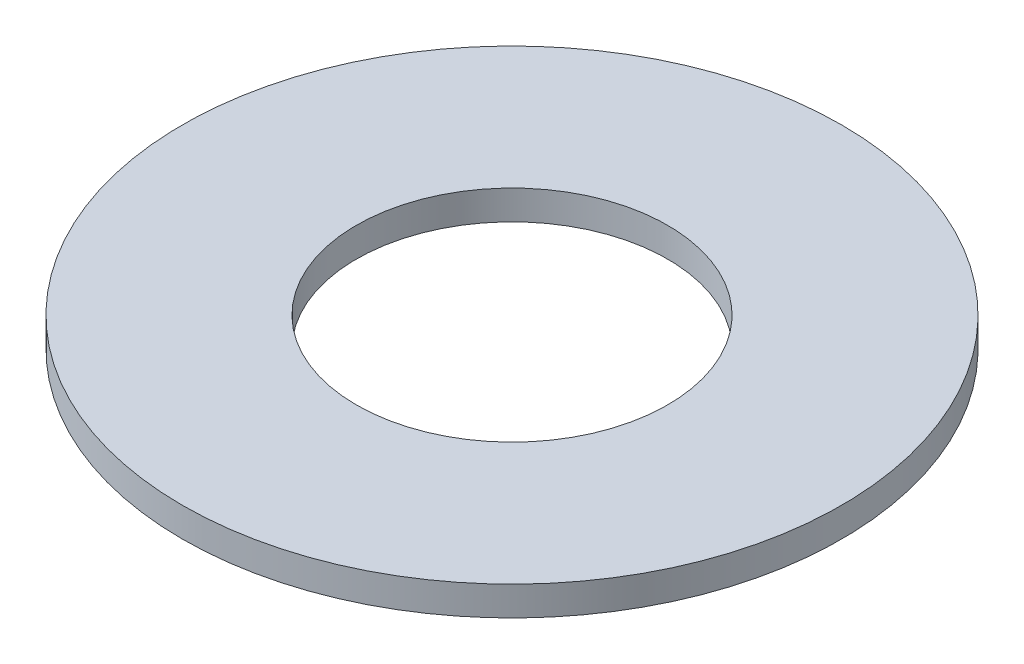
ISO-10303-21;
HEADER;
FILE_DESCRIPTION(('STEP AP214'),'2;1');
FILE_NAME('part.step','',(''),(''),'','','');
FILE_SCHEMA(('AUTOMOTIVE_DESIGN { 1 0 10303 214 1 1 1 1 }'));
ENDSEC;
DATA;
#1=APPLICATION_CONTEXT('core data for automotive mechanical design processes');
#2=APPLICATION_PROTOCOL_DEFINITION('international standard','automotive_design',2000,#1);
#3=PRODUCT_CONTEXT('',#1,'mechanical');
#4=PRODUCT('Part','Part','',(#3));
#5=PRODUCT_RELATED_PRODUCT_CATEGORY('part','',(#4));
#6=PRODUCT_DEFINITION_FORMATION('','',#4);
#7=PRODUCT_DEFINITION_CONTEXT('part definition',#1,'design');
#8=PRODUCT_DEFINITION('design','',#6,#7);
#9=PRODUCT_DEFINITION_SHAPE('','',#8);
#10=(LENGTH_UNIT() NAMED_UNIT(*) SI_UNIT(.MILLI.,.METRE.));
#11=(NAMED_UNIT(*) PLANE_ANGLE_UNIT() SI_UNIT($,.RADIAN.));
#12=(NAMED_UNIT(*) SI_UNIT($,.STERADIAN.) SOLID_ANGLE_UNIT());
#13=UNCERTAINTY_MEASURE_WITH_UNIT(LENGTH_MEASURE(1.E-05),#10,'distance_accuracy_value','');
#14=(GEOMETRIC_REPRESENTATION_CONTEXT(3) GLOBAL_UNCERTAINTY_ASSIGNED_CONTEXT((#13)) GLOBAL_UNIT_ASSIGNED_CONTEXT((#10,
#11,#12)) REPRESENTATION_CONTEXT('',''));
#15=CARTESIAN_POINT('',(0.,0.,0.));
#16=DIRECTION('',(0.,0.,1.));
#17=DIRECTION('',(1.,0.,0.));
#18=AXIS2_PLACEMENT_3D('',#15,#16,#17);
#19=CARTESIAN_POINT('',(0.,8.,0.));
#20=DIRECTION('',(0.,-1.,0.));
#21=DIRECTION('',(0.,0.,-1.));
#22=AXIS2_PLACEMENT_3D('',#19,#20,#21);
#23=CYLINDRICAL_SURFACE('',#22,90.);
#24=CARTESIAN_POINT('',(0.,8.,0.));
#25=DIRECTION('',(0.,1.,0.));
#26=DIRECTION('',(0.,0.,1.));
#27=AXIS2_PLACEMENT_3D('',#24,#25,#26);
#28=CIRCLE('',#27,90.);
#29=CARTESIAN_POINT('',(0.,8.,90.));
#30=VERTEX_POINT('',#29);
#31=EDGE_CURVE('E10',#30,#30,#28,.T.);
#32=ORIENTED_EDGE('',*,*,#31,.F.);
#33=EDGE_LOOP('',(#32));
#34=FACE_BOUND('',#33,.T.);
#35=CARTESIAN_POINT('',(0.,0.,0.));
#36=DIRECTION('',(0.,1.,0.));
#37=DIRECTION('',(0.,0.,1.));
#38=AXIS2_PLACEMENT_3D('',#35,#36,#37);
#39=CIRCLE('',#38,90.);
#40=CARTESIAN_POINT('',(0.,0.,90.));
#41=VERTEX_POINT('',#40);
#42=EDGE_CURVE('E37',#41,#41,#39,.T.);
#43=ORIENTED_EDGE('',*,*,#42,.T.);
#44=EDGE_LOOP('',(#43));
#45=FACE_BOUND('',#44,.T.);
#46=ADVANCED_FACE('F40',(#34,#45),#23,.T.);
#47=CARTESIAN_POINT('',(0.,8.,0.));
#48=DIRECTION('',(0.,1.,0.));
#49=DIRECTION('',(0.,0.,1.));
#50=AXIS2_PLACEMENT_3D('',#47,#48,#49);
#51=PLANE('',#50);
#52=CARTESIAN_POINT('',(0.,8.,0.));
#53=DIRECTION('',(0.,1.,0.));
#54=DIRECTION('',(0.,0.,1.));
#55=AXIS2_PLACEMENT_3D('',#52,#53,#54);
#56=CIRCLE('',#55,42.5);
#57=CARTESIAN_POINT('',(0.,8.,42.5));
#58=VERTEX_POINT('',#57);
#59=EDGE_CURVE('E50',#58,#58,#56,.T.);
#60=ORIENTED_EDGE('',*,*,#59,.F.);
#61=EDGE_LOOP('',(#60));
#62=FACE_BOUND('',#61,.T.);
#63=ORIENTED_EDGE('',*,*,#31,.T.);
#64=EDGE_LOOP('',(#63));
#65=FACE_BOUND('',#64,.T.);
#66=ADVANCED_FACE('F59',(#62,#65),#51,.T.);
#67=CARTESIAN_POINT('',(0.,0.,0.));
#68=DIRECTION('',(0.,1.,0.));
#69=DIRECTION('',(0.,0.,1.));
#70=AXIS2_PLACEMENT_3D('',#67,#68,#69);
#71=PLANE('',#70);
#72=CARTESIAN_POINT('',(0.,0.,0.));
#73=DIRECTION('',(0.,1.,0.));
#74=DIRECTION('',(0.,0.,1.));
#75=AXIS2_PLACEMENT_3D('',#72,#73,#74);
#76=CIRCLE('',#75,42.5);
#77=CARTESIAN_POINT('',(0.,0.,42.5));
#78=VERTEX_POINT('',#77);
#79=EDGE_CURVE('E47',#78,#78,#76,.T.);
#80=ORIENTED_EDGE('',*,*,#79,.T.);
#81=EDGE_LOOP('',(#80));
#82=FACE_BOUND('',#81,.T.);
#83=ORIENTED_EDGE('',*,*,#42,.F.);
#84=EDGE_LOOP('',(#83));
#85=FACE_BOUND('',#84,.T.);
#86=ADVANCED_FACE('F58',(#82,#85),#71,.F.);
#87=CARTESIAN_POINT('',(0.,8.,0.));
#88=DIRECTION('',(0.,-1.,0.));
#89=DIRECTION('',(0.,0.,-1.));
#90=AXIS2_PLACEMENT_3D('',#87,#88,#89);
#91=CYLINDRICAL_SURFACE('',#90,42.5);
#92=ORIENTED_EDGE('',*,*,#59,.T.);
#93=EDGE_LOOP('',(#92));
#94=FACE_BOUND('',#93,.T.);
#95=ORIENTED_EDGE('',*,*,#79,.F.);
#96=EDGE_LOOP('',(#95));
#97=FACE_BOUND('',#96,.T.);
#98=ADVANCED_FACE('F54',(#94,#97),#91,.F.);
#99=CLOSED_SHELL('',(#46,#66,#86,#98));
#100=MANIFOLD_SOLID_BREP('B2',#99);
#101=ADVANCED_BREP_SHAPE_REPRESENTATION('',(#18,#100),#14);
#102=SHAPE_DEFINITION_REPRESENTATION(#9,#101);
ENDSEC;
END-ISO-10303-21;
